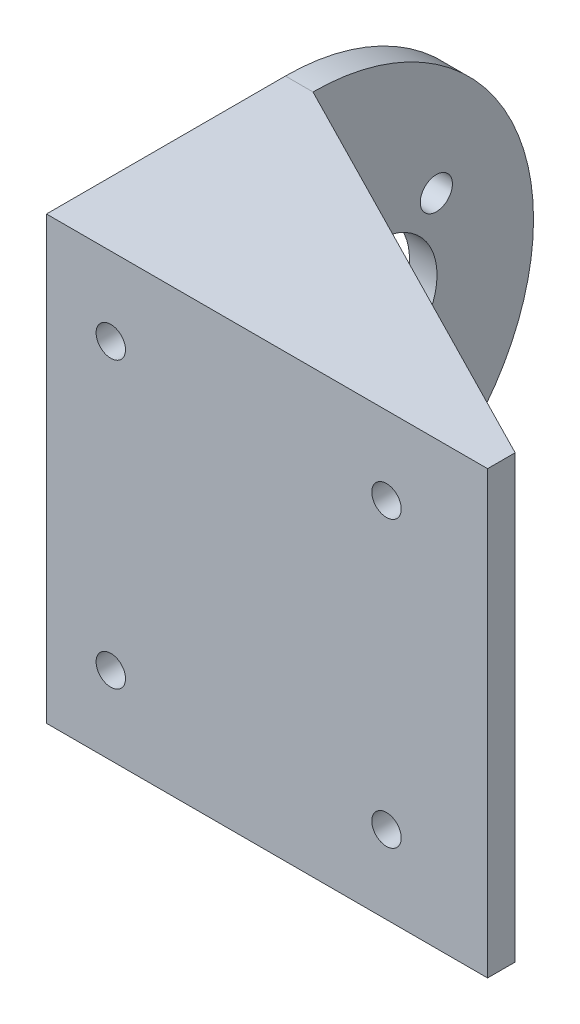
ISO-10303-21;
HEADER;
FILE_DESCRIPTION(('STEP AP214'),'2;1');
FILE_NAME('part.step','',(''),(''),'','','');
FILE_SCHEMA(('AUTOMOTIVE_DESIGN { 1 0 10303 214 1 1 1 1 }'));
ENDSEC;
DATA;
#1=APPLICATION_CONTEXT('core data for automotive mechanical design processes');
#2=APPLICATION_PROTOCOL_DEFINITION('international standard','automotive_design',2000,#1);
#3=PRODUCT_CONTEXT('',#1,'mechanical');
#4=PRODUCT('Part','Part','',(#3));
#5=PRODUCT_RELATED_PRODUCT_CATEGORY('part','',(#4));
#6=PRODUCT_DEFINITION_FORMATION('','',#4);
#7=PRODUCT_DEFINITION_CONTEXT('part definition',#1,'design');
#8=PRODUCT_DEFINITION('design','',#6,#7);
#9=PRODUCT_DEFINITION_SHAPE('','',#8);
#10=(LENGTH_UNIT() NAMED_UNIT(*) SI_UNIT(.MILLI.,.METRE.));
#11=(NAMED_UNIT(*) PLANE_ANGLE_UNIT() SI_UNIT($,.RADIAN.));
#12=(NAMED_UNIT(*) SI_UNIT($,.STERADIAN.) SOLID_ANGLE_UNIT());
#13=UNCERTAINTY_MEASURE_WITH_UNIT(LENGTH_MEASURE(1.E-05),#10,'distance_accuracy_value','');
#14=(GEOMETRIC_REPRESENTATION_CONTEXT(3) GLOBAL_UNCERTAINTY_ASSIGNED_CONTEXT((#13)) GLOBAL_UNIT_ASSIGNED_CONTEXT((#10,
#11,#12)) REPRESENTATION_CONTEXT('',''));
#15=CARTESIAN_POINT('',(0.,0.,0.));
#16=DIRECTION('',(0.,0.,1.));
#17=DIRECTION('',(1.,0.,0.));
#18=AXIS2_PLACEMENT_3D('',#15,#16,#17);
#19=CARTESIAN_POINT('',(0.,0.,0.));
#20=DIRECTION('',(0.,0.,-1.));
#21=DIRECTION('',(-1.,0.,0.));
#22=AXIS2_PLACEMENT_3D('',#19,#20,#21);
#23=PLANE('',#22);
#24=CARTESIAN_POINT('',(34.,8.49999999999999,0.));
#25=DIRECTION('',(0.,0.,1.));
#26=DIRECTION('',(1.,0.,0.));
#27=AXIS2_PLACEMENT_3D('',#24,#25,#26);
#28=CIRCLE('',#27,1.6);
#29=CARTESIAN_POINT('',(35.6,8.49999999999999,0.));
#30=VERTEX_POINT('',#29);
#31=EDGE_CURVE('E194',#30,#30,#28,.T.);
#32=ORIENTED_EDGE('',*,*,#31,.T.);
#33=EDGE_LOOP('',(#32));
#34=FACE_BOUND('',#33,.T.);
#35=CARTESIAN_POINT('',(4.,8.5,0.));
#36=DIRECTION('',(0.,0.,1.));
#37=DIRECTION('',(1.,0.,0.));
#38=AXIS2_PLACEMENT_3D('',#35,#36,#37);
#39=CIRCLE('',#38,1.6);
#40=CARTESIAN_POINT('',(5.6,8.5,0.));
#41=VERTEX_POINT('',#40);
#42=EDGE_CURVE('E206',#41,#41,#39,.T.);
#43=ORIENTED_EDGE('',*,*,#42,.T.);
#44=EDGE_LOOP('',(#43));
#45=FACE_BOUND('',#44,.T.);
#46=CARTESIAN_POINT('',(4.,39.5,0.));
#47=DIRECTION('',(0.,0.,1.));
#48=DIRECTION('',(1.,0.,0.));
#49=AXIS2_PLACEMENT_3D('',#46,#47,#48);
#50=CIRCLE('',#49,1.6);
#51=CARTESIAN_POINT('',(5.6,39.5,0.));
#52=VERTEX_POINT('',#51);
#53=EDGE_CURVE('E200',#52,#52,#50,.T.);
#54=ORIENTED_EDGE('',*,*,#53,.T.);
#55=EDGE_LOOP('',(#54));
#56=FACE_BOUND('',#55,.T.);
#57=CARTESIAN_POINT('',(34.,39.5,0.));
#58=DIRECTION('',(0.,0.,1.));
#59=DIRECTION('',(1.,0.,0.));
#60=AXIS2_PLACEMENT_3D('',#57,#58,#59);
#61=CIRCLE('',#60,1.6);
#62=CARTESIAN_POINT('',(35.6,39.5,0.));
#63=VERTEX_POINT('',#62);
#64=EDGE_CURVE('E190',#63,#63,#61,.T.);
#65=ORIENTED_EDGE('',*,*,#64,.T.);
#66=EDGE_LOOP('',(#65));
#67=FACE_BOUND('',#66,.T.);
#68=DIRECTION('',(0.,1.,0.));
#69=VECTOR('',#68,1.);
#70=CARTESIAN_POINT('',(45.,0.,0.));
#71=LINE('',#70,#69);
#72=CARTESIAN_POINT('',(45.,3.,0.));
#73=VERTEX_POINT('',#72);
#74=CARTESIAN_POINT('',(45.,45.,0.));
#75=VERTEX_POINT('',#74);
#76=EDGE_CURVE('E133',#73,#75,#71,.T.);
#77=ORIENTED_EDGE('',*,*,#76,.F.);
#78=DIRECTION('',(1.,0.,0.));
#79=VECTOR('',#78,1.);
#80=CARTESIAN_POINT('',(0.,3.,0.));
#81=LINE('',#80,#79);
#82=CARTESIAN_POINT('',(0.,3.,0.));
#83=VERTEX_POINT('',#82);
#84=EDGE_CURVE('E122',#83,#73,#81,.T.);
#85=ORIENTED_EDGE('',*,*,#84,.F.);
#86=DIRECTION('',(0.,-1.,0.));
#87=VECTOR('',#86,1.);
#88=CARTESIAN_POINT('',(0.,0.,0.));
#89=LINE('',#88,#87);
#90=CARTESIAN_POINT('',(0.,45.,0.));
#91=VERTEX_POINT('',#90);
#92=EDGE_CURVE('E138',#91,#83,#89,.T.);
#93=ORIENTED_EDGE('',*,*,#92,.F.);
#94=DIRECTION('',(1.,0.,0.));
#95=VECTOR('',#94,1.);
#96=CARTESIAN_POINT('',(0.,45.,0.));
#97=LINE('',#96,#95);
#98=EDGE_CURVE('E134',#91,#75,#97,.T.);
#99=ORIENTED_EDGE('',*,*,#98,.T.);
#100=EDGE_LOOP('',(#77,#85,#93,#99));
#101=FACE_BOUND('',#100,.T.);
#102=ADVANCED_FACE('F46',(#34,#45,#56,#67,#101),#23,.T.);
#103=CARTESIAN_POINT('',(0.,24.,-23.));
#104=DIRECTION('',(1.,0.,0.));
#105=DIRECTION('',(0.,0.,-1.));
#106=AXIS2_PLACEMENT_3D('',#103,#104,#105);
#107=PLANE('',#106);
#108=CARTESIAN_POINT('',(0.,31.75,-9.57660624134122));
#109=DIRECTION('',(1.,0.,0.));
#110=DIRECTION('',(0.,0.,-1.));
#111=AXIS2_PLACEMENT_3D('',#108,#109,#110);
#112=CIRCLE('',#111,1.75);
#113=CARTESIAN_POINT('',(0.,31.75,-11.3266062413412));
#114=VERTEX_POINT('',#113);
#115=EDGE_CURVE('E50',#114,#114,#112,.T.);
#116=ORIENTED_EDGE('',*,*,#115,.F.);
#117=EDGE_LOOP('',(#116));
#118=FACE_BOUND('',#117,.T.);
#119=CARTESIAN_POINT('',(0.,16.25,-9.5766062413412));
#120=DIRECTION('',(1.,0.,0.));
#121=DIRECTION('',(0.,0.,-1.));
#122=AXIS2_PLACEMENT_3D('',#119,#120,#121);
#123=CIRCLE('',#122,1.75);
#124=CARTESIAN_POINT('',(0.,16.25,-11.3266062413412));
#125=VERTEX_POINT('',#124);
#126=EDGE_CURVE('E163',#125,#125,#123,.T.);
#127=ORIENTED_EDGE('',*,*,#126,.F.);
#128=EDGE_LOOP('',(#127));
#129=FACE_BOUND('',#128,.T.);
#130=CARTESIAN_POINT('',(0.,8.5,-23.));
#131=DIRECTION('',(1.,0.,0.));
#132=DIRECTION('',(0.,0.,-1.));
#133=AXIS2_PLACEMENT_3D('',#130,#131,#132);
#134=CIRCLE('',#133,1.75);
#135=CARTESIAN_POINT('',(0.,8.5,-24.75));
#136=VERTEX_POINT('',#135);
#137=EDGE_CURVE('E161',#136,#136,#134,.T.);
#138=ORIENTED_EDGE('',*,*,#137,.F.);
#139=EDGE_LOOP('',(#138));
#140=FACE_BOUND('',#139,.T.);
#141=CARTESIAN_POINT('',(0.,16.25,-36.4233937586588));
#142=DIRECTION('',(1.,0.,0.));
#143=DIRECTION('',(0.,0.,-1.));
#144=AXIS2_PLACEMENT_3D('',#141,#142,#143);
#145=CIRCLE('',#144,1.75);
#146=CARTESIAN_POINT('',(0.,16.25,-38.1733937586588));
#147=VERTEX_POINT('',#146);
#148=EDGE_CURVE('E158',#147,#147,#145,.T.);
#149=ORIENTED_EDGE('',*,*,#148,.F.);
#150=EDGE_LOOP('',(#149));
#151=FACE_BOUND('',#150,.T.);
#152=CARTESIAN_POINT('',(0.,39.5,-23.));
#153=DIRECTION('',(1.,0.,0.));
#154=DIRECTION('',(0.,0.,-1.));
#155=AXIS2_PLACEMENT_3D('',#152,#153,#154);
#156=CIRCLE('',#155,1.75);
#157=CARTESIAN_POINT('',(0.,39.5,-24.75));
#158=VERTEX_POINT('',#157);
#159=EDGE_CURVE('E155',#158,#158,#156,.T.);
#160=ORIENTED_EDGE('',*,*,#159,.F.);
#161=EDGE_LOOP('',(#160));
#162=FACE_BOUND('',#161,.T.);
#163=CARTESIAN_POINT('',(0.,31.75,-36.4233937586588));
#164=DIRECTION('',(1.,0.,0.));
#165=DIRECTION('',(0.,0.,-1.));
#166=AXIS2_PLACEMENT_3D('',#163,#164,#165);
#167=CIRCLE('',#166,1.75);
#168=CARTESIAN_POINT('',(0.,31.75,-38.1733937586588));
#169=VERTEX_POINT('',#168);
#170=EDGE_CURVE('E151',#169,#169,#167,.T.);
#171=ORIENTED_EDGE('',*,*,#170,.F.);
#172=EDGE_LOOP('',(#171));
#173=FACE_BOUND('',#172,.T.);
#174=CARTESIAN_POINT('',(0.,24.,-30.));
#175=DIRECTION('',(1.,0.,0.));
#176=DIRECTION('',(0.,0.,-1.));
#177=AXIS2_PLACEMENT_3D('',#174,#175,#176);
#178=CIRCLE('',#177,6.50000000000001);
#179=CARTESIAN_POINT('',(0.,24.,-36.5));
#180=VERTEX_POINT('',#179);
#181=EDGE_CURVE('E148',#180,#180,#178,.T.);
#182=ORIENTED_EDGE('',*,*,#181,.F.);
#183=EDGE_LOOP('',(#182));
#184=FACE_BOUND('',#183,.T.);
#185=DIRECTION('',(0.,0.,1.));
#186=VECTOR('',#185,1.);
#187=CARTESIAN_POINT('',(0.,3.,3.));
#188=LINE('',#187,#186);
#189=CARTESIAN_POINT('',(0.,3.,-23.));
#190=VERTEX_POINT('',#189);
#191=EDGE_CURVE('E121',#190,#83,#188,.T.);
#192=ORIENTED_EDGE('',*,*,#191,.F.);
#193=DIRECTION('',(0.,-1.,0.));
#194=VECTOR('',#193,1.);
#195=CARTESIAN_POINT('',(0.,3.,-23.));
#196=LINE('',#195,#194);
#197=CARTESIAN_POINT('',(0.,0.,-23.));
#198=VERTEX_POINT('',#197);
#199=EDGE_CURVE('E118',#190,#198,#196,.T.);
#200=ORIENTED_EDGE('',*,*,#199,.T.);
#201=CARTESIAN_POINT('',(0.,24.,-23.));
#202=DIRECTION('',(-1.,0.,0.));
#203=DIRECTION('',(0.,0.,-1.));
#204=AXIS2_PLACEMENT_3D('',#201,#202,#203);
#205=CIRCLE('',#204,24.);
#206=CARTESIAN_POINT('',(0.,48.,-23.));
#207=VERTEX_POINT('',#206);
#208=EDGE_CURVE('E168',#207,#198,#205,.T.);
#209=ORIENTED_EDGE('',*,*,#208,.F.);
#210=DIRECTION('',(0.,1.,0.));
#211=VECTOR('',#210,1.);
#212=CARTESIAN_POINT('',(0.,45.,-23.));
#213=LINE('',#212,#211);
#214=CARTESIAN_POINT('',(0.,45.,-23.));
#215=VERTEX_POINT('',#214);
#216=EDGE_CURVE('E248',#215,#207,#213,.T.);
#217=ORIENTED_EDGE('',*,*,#216,.F.);
#218=DIRECTION('',(0.,0.,1.));
#219=VECTOR('',#218,1.);
#220=CARTESIAN_POINT('',(0.,45.,-23.));
#221=LINE('',#220,#219);
#222=EDGE_CURVE('E258',#215,#91,#221,.T.);
#223=ORIENTED_EDGE('',*,*,#222,.T.);
#224=ORIENTED_EDGE('',*,*,#92,.T.);
#225=EDGE_LOOP('',(#192,#200,#209,#217,#223,#224));
#226=FACE_BOUND('',#225,.T.);
#227=ADVANCED_FACE('F267',(#118,#129,#140,#151,#162,#173,#184,#226),#107,.T.);
#228=CARTESIAN_POINT('',(0.,0.,3.));
#229=DIRECTION('',(0.,0.,-1.));
#230=DIRECTION('',(-1.,0.,0.));
#231=AXIS2_PLACEMENT_3D('',#228,#229,#230);
#232=PLANE('',#231);
#233=DIRECTION('',(-1.,0.,0.));
#234=VECTOR('',#233,1.);
#235=CARTESIAN_POINT('',(0.,48.,3.));
#236=LINE('',#235,#234);
#237=CARTESIAN_POINT('',(45.,48.,3.));
#238=VERTEX_POINT('',#237);
#239=CARTESIAN_POINT('',(-3.,48.,3.));
#240=VERTEX_POINT('',#239);
#241=EDGE_CURVE('E146',#238,#240,#236,.T.);
#242=ORIENTED_EDGE('',*,*,#241,.T.);
#243=DIRECTION('',(0.,1.,0.));
#244=VECTOR('',#243,1.);
#245=CARTESIAN_POINT('',(-3.,48.,3.));
#246=LINE('',#245,#244);
#247=CARTESIAN_POINT('',(-3.,0.,3.));
#248=VERTEX_POINT('',#247);
#249=EDGE_CURVE('E172',#248,#240,#246,.T.);
#250=ORIENTED_EDGE('',*,*,#249,.F.);
#251=DIRECTION('',(1.,0.,0.));
#252=VECTOR('',#251,1.);
#253=CARTESIAN_POINT('',(0.,0.,3.));
#254=LINE('',#253,#252);
#255=CARTESIAN_POINT('',(45.,0.,3.));
#256=VERTEX_POINT('',#255);
#257=EDGE_CURVE('E68',#248,#256,#254,.T.);
#258=ORIENTED_EDGE('',*,*,#257,.T.);
#259=DIRECTION('',(0.,1.,0.));
#260=VECTOR('',#259,1.);
#261=CARTESIAN_POINT('',(45.,0.,3.));
#262=LINE('',#261,#260);
#263=EDGE_CURVE('E63',#256,#238,#262,.T.);
#264=ORIENTED_EDGE('',*,*,#263,.T.);
#265=EDGE_LOOP('',(#242,#250,#258,#264));
#266=FACE_BOUND('',#265,.T.);
#267=CARTESIAN_POINT('',(4.,8.5,3.));
#268=DIRECTION('',(0.,0.,1.));
#269=DIRECTION('',(1.,0.,0.));
#270=AXIS2_PLACEMENT_3D('',#267,#268,#269);
#271=CIRCLE('',#270,1.6);
#272=CARTESIAN_POINT('',(5.6,8.5,3.));
#273=VERTEX_POINT('',#272);
#274=EDGE_CURVE('E209',#273,#273,#271,.T.);
#275=ORIENTED_EDGE('',*,*,#274,.F.);
#276=EDGE_LOOP('',(#275));
#277=FACE_BOUND('',#276,.T.);
#278=CARTESIAN_POINT('',(4.,39.5,3.));
#279=DIRECTION('',(0.,0.,1.));
#280=DIRECTION('',(1.,0.,0.));
#281=AXIS2_PLACEMENT_3D('',#278,#279,#280);
#282=CIRCLE('',#281,1.6);
#283=CARTESIAN_POINT('',(5.6,39.5,3.));
#284=VERTEX_POINT('',#283);
#285=EDGE_CURVE('E203',#284,#284,#282,.T.);
#286=ORIENTED_EDGE('',*,*,#285,.F.);
#287=EDGE_LOOP('',(#286));
#288=FACE_BOUND('',#287,.T.);
#289=CARTESIAN_POINT('',(34.,8.49999999999999,3.));
#290=DIRECTION('',(0.,0.,1.));
#291=DIRECTION('',(1.,0.,0.));
#292=AXIS2_PLACEMENT_3D('',#289,#290,#291);
#293=CIRCLE('',#292,1.6);
#294=CARTESIAN_POINT('',(35.6,8.49999999999999,3.));
#295=VERTEX_POINT('',#294);
#296=EDGE_CURVE('E197',#295,#295,#293,.T.);
#297=ORIENTED_EDGE('',*,*,#296,.F.);
#298=EDGE_LOOP('',(#297));
#299=FACE_BOUND('',#298,.T.);
#300=CARTESIAN_POINT('',(34.,39.5,3.));
#301=DIRECTION('',(0.,0.,1.));
#302=DIRECTION('',(1.,0.,0.));
#303=AXIS2_PLACEMENT_3D('',#300,#301,#302);
#304=CIRCLE('',#303,1.6);
#305=CARTESIAN_POINT('',(35.6,39.5,3.));
#306=VERTEX_POINT('',#305);
#307=EDGE_CURVE('E191',#306,#306,#304,.T.);
#308=ORIENTED_EDGE('',*,*,#307,.F.);
#309=EDGE_LOOP('',(#308));
#310=FACE_BOUND('',#309,.T.);
#311=ADVANCED_FACE('F216',(#266,#277,#288,#299,#310),#232,.F.);
#312=CARTESIAN_POINT('',(0.,0.,3.));
#313=DIRECTION('',(0.,1.,0.));
#314=DIRECTION('',(0.,0.,1.));
#315=AXIS2_PLACEMENT_3D('',#312,#313,#314);
#316=PLANE('',#315);
#317=DIRECTION('',(-0.890434682196081,0.,-0.455111059789108));
#318=VECTOR('',#317,1.);
#319=CARTESIAN_POINT('',(10.5364134690681,0.,-17.6147220046985));
#320=LINE('',#319,#318);
#321=CARTESIAN_POINT('',(45.,0.,0.));
#322=VERTEX_POINT('',#321);
#323=EDGE_CURVE('E130',#322,#198,#320,.T.);
#324=ORIENTED_EDGE('',*,*,#323,.F.);
#325=DIRECTION('',(0.,0.,-1.));
#326=VECTOR('',#325,1.);
#327=CARTESIAN_POINT('',(45.,0.,3.));
#328=LINE('',#327,#326);
#329=EDGE_CURVE('E13',#256,#322,#328,.T.);
#330=ORIENTED_EDGE('',*,*,#329,.F.);
#331=ORIENTED_EDGE('',*,*,#257,.F.);
#332=DIRECTION('',(0.,0.,1.));
#333=VECTOR('',#332,1.);
#334=CARTESIAN_POINT('',(-3.,0.,3.));
#335=LINE('',#334,#333);
#336=CARTESIAN_POINT('',(-3.,0.,-23.));
#337=VERTEX_POINT('',#336);
#338=EDGE_CURVE('E184',#337,#248,#335,.T.);
#339=ORIENTED_EDGE('',*,*,#338,.F.);
#340=DIRECTION('',(1.,0.,0.));
#341=VECTOR('',#340,1.);
#342=CARTESIAN_POINT('',(-3.,0.,-23.));
#343=LINE('',#342,#341);
#344=EDGE_CURVE('E186',#337,#198,#343,.T.);
#345=ORIENTED_EDGE('',*,*,#344,.T.);
#346=EDGE_LOOP('',(#324,#330,#331,#339,#345));
#347=FACE_BOUND('',#346,.T.);
#348=ADVANCED_FACE('F48',(#347),#316,.F.);
#349=CARTESIAN_POINT('',(45.,0.,3.));
#350=DIRECTION('',(-1.,0.,0.));
#351=DIRECTION('',(0.,0.,1.));
#352=AXIS2_PLACEMENT_3D('',#349,#350,#351);
#353=PLANE('',#352);
#354=EDGE_CURVE('E116',#322,#73,#71,.T.);
#355=ORIENTED_EDGE('',*,*,#354,.T.);
#356=ORIENTED_EDGE('',*,*,#76,.T.);
#357=DIRECTION('',(0.,1.,0.));
#358=VECTOR('',#357,1.);
#359=CARTESIAN_POINT('',(45.,45.,0.));
#360=LINE('',#359,#358);
#361=CARTESIAN_POINT('',(45.,48.,0.));
#362=VERTEX_POINT('',#361);
#363=EDGE_CURVE('E251',#75,#362,#360,.T.);
#364=ORIENTED_EDGE('',*,*,#363,.T.);
#365=DIRECTION('',(0.,0.,-1.));
#366=VECTOR('',#365,1.);
#367=CARTESIAN_POINT('',(45.,48.,3.));
#368=LINE('',#367,#366);
#369=EDGE_CURVE('E55',#238,#362,#368,.T.);
#370=ORIENTED_EDGE('',*,*,#369,.F.);
#371=ORIENTED_EDGE('',*,*,#263,.F.);
#372=ORIENTED_EDGE('',*,*,#329,.T.);
#373=EDGE_LOOP('',(#355,#356,#364,#370,#371,#372));
#374=FACE_BOUND('',#373,.T.);
#375=ADVANCED_FACE('F140',(#374),#353,.F.);
#376=CARTESIAN_POINT('',(0.,48.,3.));
#377=DIRECTION('',(0.,-1.,0.));
#378=DIRECTION('',(0.,0.,-1.));
#379=AXIS2_PLACEMENT_3D('',#376,#377,#378);
#380=PLANE('',#379);
#381=ORIENTED_EDGE('',*,*,#369,.T.);
#382=DIRECTION('',(-0.890434682196081,0.,-0.455111059789108));
#383=VECTOR('',#382,1.);
#384=CARTESIAN_POINT('',(0.,48.,-23.));
#385=LINE('',#384,#383);
#386=EDGE_CURVE('E256',#362,#207,#385,.T.);
#387=ORIENTED_EDGE('',*,*,#386,.T.);
#388=DIRECTION('',(1.,0.,0.));
#389=VECTOR('',#388,1.);
#390=CARTESIAN_POINT('',(-3.,48.,-23.));
#391=LINE('',#390,#389);
#392=CARTESIAN_POINT('',(-3.,48.,-23.));
#393=VERTEX_POINT('',#392);
#394=EDGE_CURVE('E188',#393,#207,#391,.T.);
#395=ORIENTED_EDGE('',*,*,#394,.F.);
#396=DIRECTION('',(0.,0.,-1.));
#397=VECTOR('',#396,1.);
#398=CARTESIAN_POINT('',(-3.,48.,3.));
#399=LINE('',#398,#397);
#400=EDGE_CURVE('E180',#240,#393,#399,.T.);
#401=ORIENTED_EDGE('',*,*,#400,.F.);
#402=ORIENTED_EDGE('',*,*,#241,.F.);
#403=EDGE_LOOP('',(#381,#387,#395,#401,#402));
#404=FACE_BOUND('',#403,.T.);
#405=ADVANCED_FACE('F220',(#404),#380,.F.);
#406=CARTESIAN_POINT('',(4.,8.5,3.));
#407=DIRECTION('',(0.,0.,-1.));
#408=DIRECTION('',(-1.,0.,0.));
#409=AXIS2_PLACEMENT_3D('',#406,#407,#408);
#410=CYLINDRICAL_SURFACE('',#409,1.6);
#411=ORIENTED_EDGE('',*,*,#274,.T.);
#412=EDGE_LOOP('',(#411));
#413=FACE_BOUND('',#412,.T.);
#414=ORIENTED_EDGE('',*,*,#42,.F.);
#415=EDGE_LOOP('',(#414));
#416=FACE_BOUND('',#415,.T.);
#417=ADVANCED_FACE('F293',(#413,#416),#410,.F.);
#418=CARTESIAN_POINT('',(4.,39.5,3.));
#419=DIRECTION('',(0.,0.,-1.));
#420=DIRECTION('',(-1.,0.,0.));
#421=AXIS2_PLACEMENT_3D('',#418,#419,#420);
#422=CYLINDRICAL_SURFACE('',#421,1.6);
#423=ORIENTED_EDGE('',*,*,#285,.T.);
#424=EDGE_LOOP('',(#423));
#425=FACE_BOUND('',#424,.T.);
#426=ORIENTED_EDGE('',*,*,#53,.F.);
#427=EDGE_LOOP('',(#426));
#428=FACE_BOUND('',#427,.T.);
#429=ADVANCED_FACE('F297',(#425,#428),#422,.F.);
#430=CARTESIAN_POINT('',(34.,8.49999999999999,3.));
#431=DIRECTION('',(0.,0.,-1.));
#432=DIRECTION('',(-1.,0.,0.));
#433=AXIS2_PLACEMENT_3D('',#430,#431,#432);
#434=CYLINDRICAL_SURFACE('',#433,1.6);
#435=ORIENTED_EDGE('',*,*,#296,.T.);
#436=EDGE_LOOP('',(#435));
#437=FACE_BOUND('',#436,.T.);
#438=ORIENTED_EDGE('',*,*,#31,.F.);
#439=EDGE_LOOP('',(#438));
#440=FACE_BOUND('',#439,.T.);
#441=ADVANCED_FACE('F302',(#437,#440),#434,.F.);
#442=CARTESIAN_POINT('',(34.,39.5,3.));
#443=DIRECTION('',(0.,0.,-1.));
#444=DIRECTION('',(-1.,0.,0.));
#445=AXIS2_PLACEMENT_3D('',#442,#443,#444);
#446=CYLINDRICAL_SURFACE('',#445,1.6);
#447=ORIENTED_EDGE('',*,*,#307,.T.);
#448=EDGE_LOOP('',(#447));
#449=FACE_BOUND('',#448,.T.);
#450=ORIENTED_EDGE('',*,*,#64,.F.);
#451=EDGE_LOOP('',(#450));
#452=FACE_BOUND('',#451,.T.);
#453=ADVANCED_FACE('F309',(#449,#452),#446,.F.);
#454=CARTESIAN_POINT('',(-3.,24.,-23.));
#455=DIRECTION('',(1.,0.,0.));
#456=DIRECTION('',(0.,0.,-1.));
#457=AXIS2_PLACEMENT_3D('',#454,#455,#456);
#458=CYLINDRICAL_SURFACE('',#457,24.);
#459=ORIENTED_EDGE('',*,*,#208,.T.);
#460=ORIENTED_EDGE('',*,*,#344,.F.);
#461=CARTESIAN_POINT('',(-3.,24.,-23.));
#462=DIRECTION('',(-1.,0.,0.));
#463=DIRECTION('',(0.,0.,-1.));
#464=AXIS2_PLACEMENT_3D('',#461,#462,#463);
#465=CIRCLE('',#464,24.);
#466=EDGE_CURVE('E223',#393,#337,#465,.T.);
#467=ORIENTED_EDGE('',*,*,#466,.F.);
#468=ORIENTED_EDGE('',*,*,#394,.T.);
#469=EDGE_LOOP('',(#459,#460,#467,#468));
#470=FACE_BOUND('',#469,.T.);
#471=ADVANCED_FACE('F274',(#470),#458,.T.);
#472=CARTESIAN_POINT('',(-3.,24.,-23.));
#473=DIRECTION('',(1.,0.,0.));
#474=DIRECTION('',(0.,0.,-1.));
#475=AXIS2_PLACEMENT_3D('',#472,#473,#474);
#476=PLANE('',#475);
#477=CARTESIAN_POINT('',(-3.,31.75,-9.57660624134122));
#478=DIRECTION('',(-1.,0.,0.));
#479=DIRECTION('',(0.,0.,1.));
#480=AXIS2_PLACEMENT_3D('',#477,#478,#479);
#481=CIRCLE('',#480,1.75);
#482=CARTESIAN_POINT('',(-3.,31.75,-7.82660624134122));
#483=VERTEX_POINT('',#482);
#484=EDGE_CURVE('E232',#483,#483,#481,.T.);
#485=ORIENTED_EDGE('',*,*,#484,.F.);
#486=EDGE_LOOP('',(#485));
#487=FACE_BOUND('',#486,.T.);
#488=CARTESIAN_POINT('',(-3.,16.25,-9.5766062413412));
#489=DIRECTION('',(-1.,0.,0.));
#490=DIRECTION('',(0.,0.,1.));
#491=AXIS2_PLACEMENT_3D('',#488,#489,#490);
#492=CIRCLE('',#491,1.75);
#493=CARTESIAN_POINT('',(-3.,16.25,-7.8266062413412));
#494=VERTEX_POINT('',#493);
#495=EDGE_CURVE('E240',#494,#494,#492,.T.);
#496=ORIENTED_EDGE('',*,*,#495,.F.);
#497=EDGE_LOOP('',(#496));
#498=FACE_BOUND('',#497,.T.);
#499=CARTESIAN_POINT('',(-3.,8.5,-23.));
#500=DIRECTION('',(-1.,0.,0.));
#501=DIRECTION('',(0.,0.,1.));
#502=AXIS2_PLACEMENT_3D('',#499,#500,#501);
#503=CIRCLE('',#502,1.75);
#504=CARTESIAN_POINT('',(-3.,8.5,-21.25));
#505=VERTEX_POINT('',#504);
#506=EDGE_CURVE('E236',#505,#505,#503,.T.);
#507=ORIENTED_EDGE('',*,*,#506,.F.);
#508=EDGE_LOOP('',(#507));
#509=FACE_BOUND('',#508,.T.);
#510=CARTESIAN_POINT('',(-3.,16.25,-36.4233937586588));
#511=DIRECTION('',(-1.,0.,0.));
#512=DIRECTION('',(0.,0.,1.));
#513=AXIS2_PLACEMENT_3D('',#510,#511,#512);
#514=CIRCLE('',#513,1.75);
#515=CARTESIAN_POINT('',(-3.,16.25,-34.6733937586588));
#516=VERTEX_POINT('',#515);
#517=EDGE_CURVE('E233',#516,#516,#514,.T.);
#518=ORIENTED_EDGE('',*,*,#517,.F.);
#519=EDGE_LOOP('',(#518));
#520=FACE_BOUND('',#519,.T.);
#521=CARTESIAN_POINT('',(-3.,39.5,-23.));
#522=DIRECTION('',(-1.,0.,0.));
#523=DIRECTION('',(0.,0.,1.));
#524=AXIS2_PLACEMENT_3D('',#521,#522,#523);
#525=CIRCLE('',#524,1.75);
#526=CARTESIAN_POINT('',(-3.,39.5,-21.25));
#527=VERTEX_POINT('',#526);
#528=EDGE_CURVE('E237',#527,#527,#525,.T.);
#529=ORIENTED_EDGE('',*,*,#528,.F.);
#530=EDGE_LOOP('',(#529));
#531=FACE_BOUND('',#530,.T.);
#532=CARTESIAN_POINT('',(-3.,31.75,-36.4233937586588));
#533=DIRECTION('',(-1.,0.,0.));
#534=DIRECTION('',(0.,0.,1.));
#535=AXIS2_PLACEMENT_3D('',#532,#533,#534);
#536=CIRCLE('',#535,1.75);
#537=CARTESIAN_POINT('',(-3.,31.75,-34.6733937586588));
#538=VERTEX_POINT('',#537);
#539=EDGE_CURVE('E245',#538,#538,#536,.T.);
#540=ORIENTED_EDGE('',*,*,#539,.F.);
#541=EDGE_LOOP('',(#540));
#542=FACE_BOUND('',#541,.T.);
#543=CARTESIAN_POINT('',(-3.,24.,-30.));
#544=DIRECTION('',(-1.,0.,0.));
#545=DIRECTION('',(0.,0.,1.));
#546=AXIS2_PLACEMENT_3D('',#543,#544,#545);
#547=CIRCLE('',#546,6.50000000000001);
#548=CARTESIAN_POINT('',(-3.,24.,-23.5));
#549=VERTEX_POINT('',#548);
#550=EDGE_CURVE('E152',#549,#549,#547,.T.);
#551=ORIENTED_EDGE('',*,*,#550,.F.);
#552=EDGE_LOOP('',(#551));
#553=FACE_BOUND('',#552,.T.);
#554=ORIENTED_EDGE('',*,*,#249,.T.);
#555=ORIENTED_EDGE('',*,*,#400,.T.);
#556=ORIENTED_EDGE('',*,*,#466,.T.);
#557=ORIENTED_EDGE('',*,*,#338,.T.);
#558=EDGE_LOOP('',(#554,#555,#556,#557));
#559=FACE_BOUND('',#558,.T.);
#560=ADVANCED_FACE('F226',(#487,#498,#509,#520,#531,#542,#553,#559),#476,.F.);
#561=CARTESIAN_POINT('',(7.,24.,-30.));
#562=DIRECTION('',(-1.,0.,0.));
#563=DIRECTION('',(0.,0.,1.));
#564=AXIS2_PLACEMENT_3D('',#561,#562,#563);
#565=CYLINDRICAL_SURFACE('',#564,6.50000000000001);
#566=ORIENTED_EDGE('',*,*,#181,.T.);
#567=EDGE_LOOP('',(#566));
#568=FACE_BOUND('',#567,.T.);
#569=ORIENTED_EDGE('',*,*,#550,.T.);
#570=EDGE_LOOP('',(#569));
#571=FACE_BOUND('',#570,.T.);
#572=ADVANCED_FACE('F318',(#568,#571),#565,.F.);
#573=CARTESIAN_POINT('',(7.,31.75,-36.4233937586588));
#574=DIRECTION('',(-1.,0.,0.));
#575=DIRECTION('',(0.,0.,1.));
#576=AXIS2_PLACEMENT_3D('',#573,#574,#575);
#577=CYLINDRICAL_SURFACE('',#576,1.75);
#578=ORIENTED_EDGE('',*,*,#170,.T.);
#579=EDGE_LOOP('',(#578));
#580=FACE_BOUND('',#579,.T.);
#581=ORIENTED_EDGE('',*,*,#539,.T.);
#582=EDGE_LOOP('',(#581));
#583=FACE_BOUND('',#582,.T.);
#584=ADVANCED_FACE('F322',(#580,#583),#577,.F.);
#585=CARTESIAN_POINT('',(7.,39.5,-23.));
#586=DIRECTION('',(-1.,0.,0.));
#587=DIRECTION('',(0.,0.,1.));
#588=AXIS2_PLACEMENT_3D('',#585,#586,#587);
#589=CYLINDRICAL_SURFACE('',#588,1.75);
#590=ORIENTED_EDGE('',*,*,#159,.T.);
#591=EDGE_LOOP('',(#590));
#592=FACE_BOUND('',#591,.T.);
#593=ORIENTED_EDGE('',*,*,#528,.T.);
#594=EDGE_LOOP('',(#593));
#595=FACE_BOUND('',#594,.T.);
#596=ADVANCED_FACE('F328',(#592,#595),#589,.F.);
#597=CARTESIAN_POINT('',(7.,16.25,-36.4233937586588));
#598=DIRECTION('',(-1.,0.,0.));
#599=DIRECTION('',(0.,0.,1.));
#600=AXIS2_PLACEMENT_3D('',#597,#598,#599);
#601=CYLINDRICAL_SURFACE('',#600,1.75);
#602=ORIENTED_EDGE('',*,*,#148,.T.);
#603=EDGE_LOOP('',(#602));
#604=FACE_BOUND('',#603,.T.);
#605=ORIENTED_EDGE('',*,*,#517,.T.);
#606=EDGE_LOOP('',(#605));
#607=FACE_BOUND('',#606,.T.);
#608=ADVANCED_FACE('F324',(#604,#607),#601,.F.);
#609=CARTESIAN_POINT('',(7.,8.5,-23.));
#610=DIRECTION('',(-1.,0.,0.));
#611=DIRECTION('',(0.,0.,1.));
#612=AXIS2_PLACEMENT_3D('',#609,#610,#611);
#613=CYLINDRICAL_SURFACE('',#612,1.75);
#614=ORIENTED_EDGE('',*,*,#137,.T.);
#615=EDGE_LOOP('',(#614));
#616=FACE_BOUND('',#615,.T.);
#617=ORIENTED_EDGE('',*,*,#506,.T.);
#618=EDGE_LOOP('',(#617));
#619=FACE_BOUND('',#618,.T.);
#620=ADVANCED_FACE('F327',(#616,#619),#613,.F.);
#621=CARTESIAN_POINT('',(7.,16.25,-9.5766062413412));
#622=DIRECTION('',(-1.,0.,0.));
#623=DIRECTION('',(0.,0.,1.));
#624=AXIS2_PLACEMENT_3D('',#621,#622,#623);
#625=CYLINDRICAL_SURFACE('',#624,1.75);
#626=ORIENTED_EDGE('',*,*,#126,.T.);
#627=EDGE_LOOP('',(#626));
#628=FACE_BOUND('',#627,.T.);
#629=ORIENTED_EDGE('',*,*,#495,.T.);
#630=EDGE_LOOP('',(#629));
#631=FACE_BOUND('',#630,.T.);
#632=ADVANCED_FACE('F332',(#628,#631),#625,.F.);
#633=CARTESIAN_POINT('',(7.,31.75,-9.57660624134122));
#634=DIRECTION('',(-1.,0.,0.));
#635=DIRECTION('',(0.,0.,1.));
#636=AXIS2_PLACEMENT_3D('',#633,#634,#635);
#637=CYLINDRICAL_SURFACE('',#636,1.75);
#638=ORIENTED_EDGE('',*,*,#115,.T.);
#639=EDGE_LOOP('',(#638));
#640=FACE_BOUND('',#639,.T.);
#641=ORIENTED_EDGE('',*,*,#484,.T.);
#642=EDGE_LOOP('',(#641));
#643=FACE_BOUND('',#642,.T.);
#644=ADVANCED_FACE('F336',(#640,#643),#637,.F.);
#645=CARTESIAN_POINT('',(0.,45.,-23.));
#646=DIRECTION('',(0.455111059789108,0.,-0.890434682196081));
#647=DIRECTION('',(-0.890434682196081,0.,-0.455111059789108));
#648=AXIS2_PLACEMENT_3D('',#645,#646,#647);
#649=PLANE('',#648);
#650=ORIENTED_EDGE('',*,*,#386,.F.);
#651=ORIENTED_EDGE('',*,*,#363,.F.);
#652=DIRECTION('',(-0.890434682196081,0.,-0.455111059789108));
#653=VECTOR('',#652,1.);
#654=CARTESIAN_POINT('',(0.,45.,-23.));
#655=LINE('',#654,#653);
#656=EDGE_CURVE('E253',#75,#215,#655,.T.);
#657=ORIENTED_EDGE('',*,*,#656,.T.);
#658=ORIENTED_EDGE('',*,*,#216,.T.);
#659=EDGE_LOOP('',(#650,#651,#657,#658));
#660=FACE_BOUND('',#659,.T.);
#661=ADVANCED_FACE('F273',(#660),#649,.T.);
#662=CARTESIAN_POINT('',(0.,45.,0.));
#663=DIRECTION('',(0.,1.,0.));
#664=DIRECTION('',(0.,0.,1.));
#665=AXIS2_PLACEMENT_3D('',#662,#663,#664);
#666=PLANE('',#665);
#667=ORIENTED_EDGE('',*,*,#222,.F.);
#668=ORIENTED_EDGE('',*,*,#656,.F.);
#669=ORIENTED_EDGE('',*,*,#98,.F.);
#670=EDGE_LOOP('',(#667,#668,#669));
#671=FACE_BOUND('',#670,.T.);
#672=ADVANCED_FACE('F271',(#671),#666,.F.);
#673=CARTESIAN_POINT('',(10.5364134690681,3.,-17.6147220046985));
#674=DIRECTION('',(-0.455111059789108,0.,0.890434682196081));
#675=DIRECTION('',(0.890434682196081,0.,0.455111059789108));
#676=AXIS2_PLACEMENT_3D('',#673,#674,#675);
#677=PLANE('',#676);
#678=ORIENTED_EDGE('',*,*,#323,.T.);
#679=ORIENTED_EDGE('',*,*,#199,.F.);
#680=DIRECTION('',(-0.890434682196081,0.,-0.455111059789108));
#681=VECTOR('',#680,1.);
#682=CARTESIAN_POINT('',(10.5364134690681,3.,-17.6147220046985));
#683=LINE('',#682,#681);
#684=EDGE_CURVE('E112',#73,#190,#683,.T.);
#685=ORIENTED_EDGE('',*,*,#684,.F.);
#686=ORIENTED_EDGE('',*,*,#354,.F.);
#687=EDGE_LOOP('',(#678,#679,#685,#686));
#688=FACE_BOUND('',#687,.T.);
#689=ADVANCED_FACE('F114',(#688),#677,.F.);
#690=CARTESIAN_POINT('',(0.,3.,0.));
#691=DIRECTION('',(0.,-1.,0.));
#692=DIRECTION('',(0.,0.,-1.));
#693=AXIS2_PLACEMENT_3D('',#690,#691,#692);
#694=PLANE('',#693);
#695=ORIENTED_EDGE('',*,*,#84,.T.);
#696=ORIENTED_EDGE('',*,*,#684,.T.);
#697=ORIENTED_EDGE('',*,*,#191,.T.);
#698=EDGE_LOOP('',(#695,#696,#697));
#699=FACE_BOUND('',#698,.T.);
#700=ADVANCED_FACE('F126',(#699),#694,.F.);
#701=CLOSED_SHELL('',(#102,#227,#311,#348,#375,#405,#417,#429,#441,#453,#471,#560,#572,#584,
#596,#608,#620,#632,#644,#661,#672,#689,#700));
#702=MANIFOLD_SOLID_BREP('B2',#701);
#703=ADVANCED_BREP_SHAPE_REPRESENTATION('',(#18,#702),#14);
#704=SHAPE_DEFINITION_REPRESENTATION(#9,#703);
ENDSEC;
END-ISO-10303-21;
